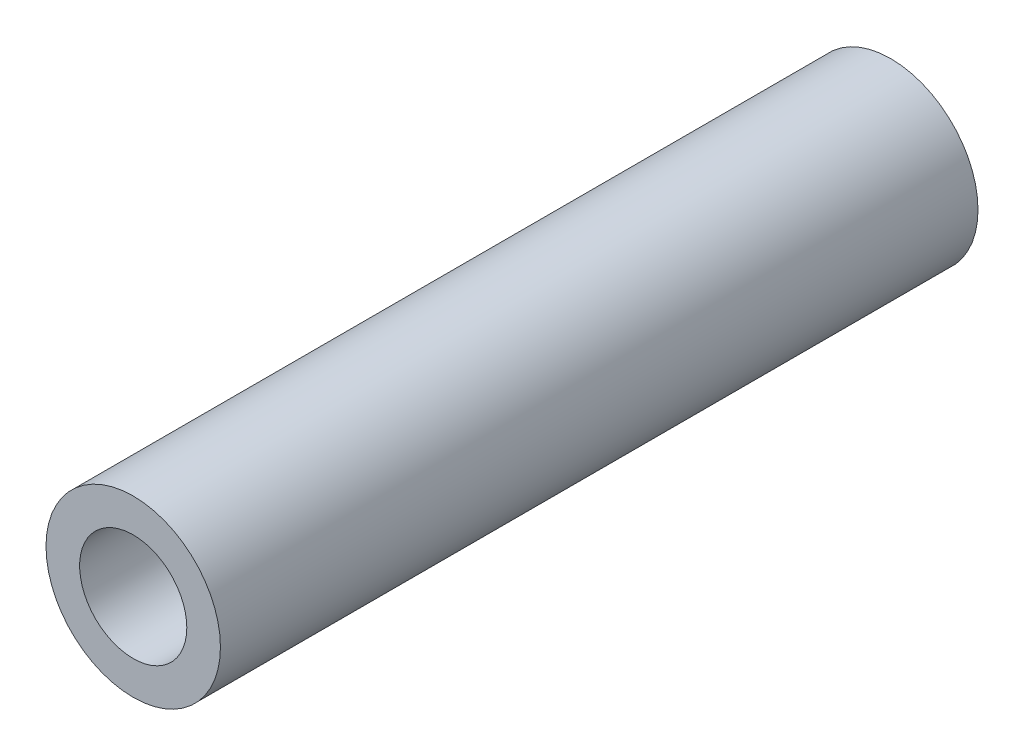
ISO-10303-21;
HEADER;
FILE_DESCRIPTION(('STEP AP214'),'2;1');
FILE_NAME('part.step','',(''),(''),'','','');
FILE_SCHEMA(('AUTOMOTIVE_DESIGN { 1 0 10303 214 1 1 1 1 }'));
ENDSEC;
DATA;
#1=APPLICATION_CONTEXT('core data for automotive mechanical design processes');
#2=APPLICATION_PROTOCOL_DEFINITION('international standard','automotive_design',2000,#1);
#3=PRODUCT_CONTEXT('',#1,'mechanical');
#4=PRODUCT('Part','Part','',(#3));
#5=PRODUCT_RELATED_PRODUCT_CATEGORY('part','',(#4));
#6=PRODUCT_DEFINITION_FORMATION('','',#4);
#7=PRODUCT_DEFINITION_CONTEXT('part definition',#1,'design');
#8=PRODUCT_DEFINITION('design','',#6,#7);
#9=PRODUCT_DEFINITION_SHAPE('','',#8);
#10=(LENGTH_UNIT() NAMED_UNIT(*) SI_UNIT(.MILLI.,.METRE.));
#11=(NAMED_UNIT(*) PLANE_ANGLE_UNIT() SI_UNIT($,.RADIAN.));
#12=(NAMED_UNIT(*) SI_UNIT($,.STERADIAN.) SOLID_ANGLE_UNIT());
#13=UNCERTAINTY_MEASURE_WITH_UNIT(LENGTH_MEASURE(1.E-05),#10,'distance_accuracy_value','');
#14=(GEOMETRIC_REPRESENTATION_CONTEXT(3) GLOBAL_UNCERTAINTY_ASSIGNED_CONTEXT((#13)) GLOBAL_UNIT_ASSIGNED_CONTEXT((#10,
#11,#12)) REPRESENTATION_CONTEXT('',''));
#15=CARTESIAN_POINT('',(0.,0.,0.));
#16=DIRECTION('',(0.,0.,1.));
#17=DIRECTION('',(1.,0.,0.));
#18=AXIS2_PLACEMENT_3D('',#15,#16,#17);
#19=CARTESIAN_POINT('',(0.,0.,30.4));
#20=DIRECTION('',(0.,0.,1.));
#21=DIRECTION('',(1.,0.,0.));
#22=AXIS2_PLACEMENT_3D('',#19,#20,#21);
#23=PLANE('',#22);
#24=CARTESIAN_POINT('',(0.,0.,30.4));
#25=DIRECTION('',(0.,0.,1.));
#26=DIRECTION('',(1.,0.,0.));
#27=AXIS2_PLACEMENT_3D('',#24,#25,#26);
#28=CIRCLE('',#27,3.5);
#29=CARTESIAN_POINT('',(3.5,0.,30.4));
#30=VERTEX_POINT('',#29);
#31=EDGE_CURVE('E10',#30,#30,#28,.T.);
#32=ORIENTED_EDGE('',*,*,#31,.T.);
#33=EDGE_LOOP('',(#32));
#34=FACE_BOUND('',#33,.T.);
#35=CARTESIAN_POINT('',(0.,0.,30.4));
#36=DIRECTION('',(0.,0.,1.));
#37=DIRECTION('',(1.,0.,0.));
#38=AXIS2_PLACEMENT_3D('',#35,#36,#37);
#39=CIRCLE('',#38,2.15);
#40=CARTESIAN_POINT('',(2.15,0.,30.4));
#41=VERTEX_POINT('',#40);
#42=EDGE_CURVE('E43',#41,#41,#39,.T.);
#43=ORIENTED_EDGE('',*,*,#42,.F.);
#44=EDGE_LOOP('',(#43));
#45=FACE_BOUND('',#44,.T.);
#46=ADVANCED_FACE('F32',(#34,#45),#23,.T.);
#47=CARTESIAN_POINT('',(0.,0.,0.));
#48=DIRECTION('',(0.,0.,1.));
#49=DIRECTION('',(1.,0.,0.));
#50=AXIS2_PLACEMENT_3D('',#47,#48,#49);
#51=PLANE('',#50);
#52=CARTESIAN_POINT('',(0.,0.,0.));
#53=DIRECTION('',(0.,0.,1.));
#54=DIRECTION('',(1.,0.,0.));
#55=AXIS2_PLACEMENT_3D('',#52,#53,#54);
#56=CIRCLE('',#55,3.5);
#57=CARTESIAN_POINT('',(3.5,0.,0.));
#58=VERTEX_POINT('',#57);
#59=EDGE_CURVE('E36',#58,#58,#56,.T.);
#60=ORIENTED_EDGE('',*,*,#59,.F.);
#61=EDGE_LOOP('',(#60));
#62=FACE_BOUND('',#61,.T.);
#63=CARTESIAN_POINT('',(0.,0.,0.));
#64=DIRECTION('',(0.,0.,1.));
#65=DIRECTION('',(1.,0.,0.));
#66=AXIS2_PLACEMENT_3D('',#63,#64,#65);
#67=CIRCLE('',#66,2.15);
#68=CARTESIAN_POINT('',(2.15,0.,0.));
#69=VERTEX_POINT('',#68);
#70=EDGE_CURVE('E45',#69,#69,#67,.T.);
#71=ORIENTED_EDGE('',*,*,#70,.T.);
#72=EDGE_LOOP('',(#71));
#73=FACE_BOUND('',#72,.T.);
#74=ADVANCED_FACE('F55',(#62,#73),#51,.F.);
#75=CARTESIAN_POINT('',(0.,0.,30.4));
#76=DIRECTION('',(0.,0.,-1.));
#77=DIRECTION('',(-1.,0.,0.));
#78=AXIS2_PLACEMENT_3D('',#75,#76,#77);
#79=CYLINDRICAL_SURFACE('',#78,3.5);
#80=ORIENTED_EDGE('',*,*,#31,.F.);
#81=EDGE_LOOP('',(#80));
#82=FACE_BOUND('',#81,.T.);
#83=ORIENTED_EDGE('',*,*,#59,.T.);
#84=EDGE_LOOP('',(#83));
#85=FACE_BOUND('',#84,.T.);
#86=ADVANCED_FACE('F34',(#82,#85),#79,.T.);
#87=CARTESIAN_POINT('',(0.,0.,30.4));
#88=DIRECTION('',(0.,0.,-1.));
#89=DIRECTION('',(-1.,0.,0.));
#90=AXIS2_PLACEMENT_3D('',#87,#88,#89);
#91=CYLINDRICAL_SURFACE('',#90,2.15);
#92=ORIENTED_EDGE('',*,*,#42,.T.);
#93=EDGE_LOOP('',(#92));
#94=FACE_BOUND('',#93,.T.);
#95=ORIENTED_EDGE('',*,*,#70,.F.);
#96=EDGE_LOOP('',(#95));
#97=FACE_BOUND('',#96,.T.);
#98=ADVANCED_FACE('F51',(#94,#97),#91,.F.);
#99=CLOSED_SHELL('',(#46,#74,#86,#98));
#100=MANIFOLD_SOLID_BREP('B2',#99);
#101=ADVANCED_BREP_SHAPE_REPRESENTATION('',(#18,#100),#14);
#102=SHAPE_DEFINITION_REPRESENTATION(#9,#101);
ENDSEC;
END-ISO-10303-21;
